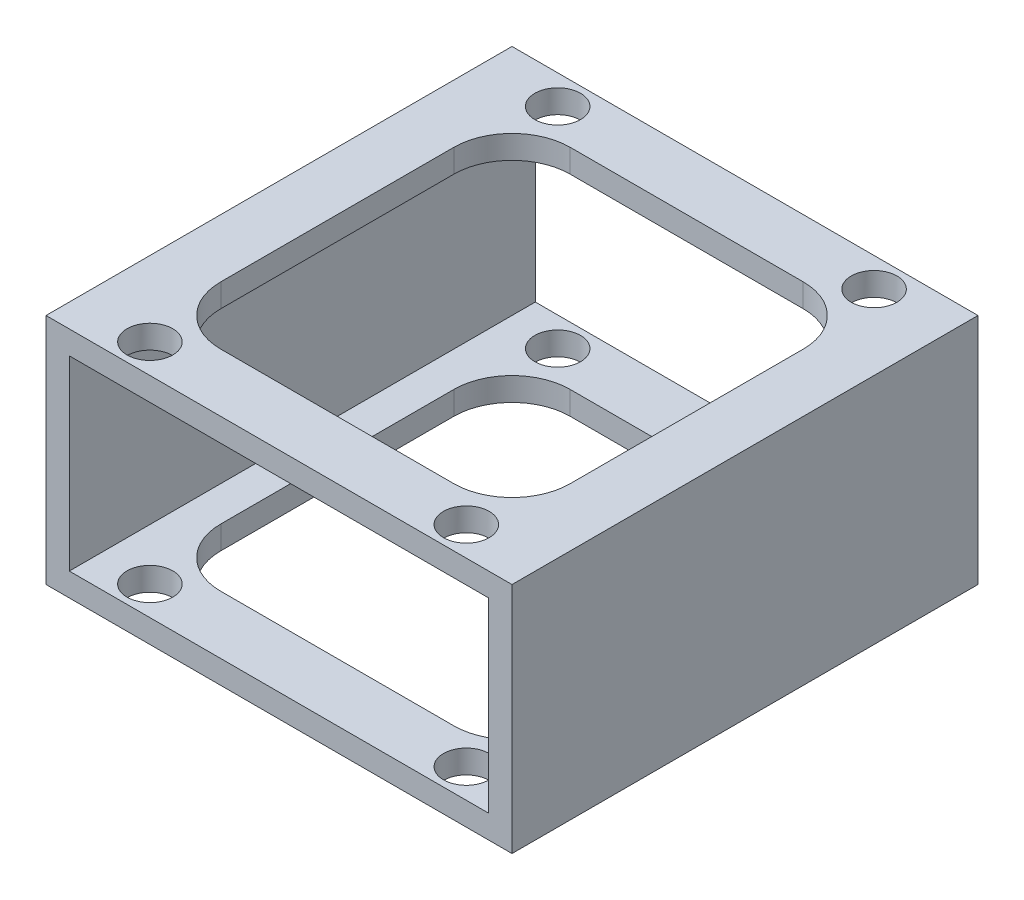
ISO-10303-21;
HEADER;
FILE_DESCRIPTION(('STEP AP214'),'2;1');
FILE_NAME('part.step','',(''),(''),'','','');
FILE_SCHEMA(('AUTOMOTIVE_DESIGN { 1 0 10303 214 1 1 1 1 }'));
ENDSEC;
DATA;
#1=APPLICATION_CONTEXT('core data for automotive mechanical design processes');
#2=APPLICATION_PROTOCOL_DEFINITION('international standard','automotive_design',2000,#1);
#3=PRODUCT_CONTEXT('',#1,'mechanical');
#4=PRODUCT('Part','Part','',(#3));
#5=PRODUCT_RELATED_PRODUCT_CATEGORY('part','',(#4));
#6=PRODUCT_DEFINITION_FORMATION('','',#4);
#7=PRODUCT_DEFINITION_CONTEXT('part definition',#1,'design');
#8=PRODUCT_DEFINITION('design','',#6,#7);
#9=PRODUCT_DEFINITION_SHAPE('','',#8);
#10=(LENGTH_UNIT() NAMED_UNIT(*) SI_UNIT(.MILLI.,.METRE.));
#11=(NAMED_UNIT(*) PLANE_ANGLE_UNIT() SI_UNIT($,.RADIAN.));
#12=(NAMED_UNIT(*) SI_UNIT($,.STERADIAN.) SOLID_ANGLE_UNIT());
#13=UNCERTAINTY_MEASURE_WITH_UNIT(LENGTH_MEASURE(1.E-05),#10,'distance_accuracy_value','');
#14=(GEOMETRIC_REPRESENTATION_CONTEXT(3) GLOBAL_UNCERTAINTY_ASSIGNED_CONTEXT((#13)) GLOBAL_UNIT_ASSIGNED_CONTEXT((#10,
#11,#12)) REPRESENTATION_CONTEXT('',''));
#15=CARTESIAN_POINT('',(0.,0.,0.));
#16=DIRECTION('',(0.,0.,1.));
#17=DIRECTION('',(1.,0.,0.));
#18=AXIS2_PLACEMENT_3D('',#15,#16,#17);
#19=CARTESIAN_POINT('',(-25.4,12.7,50.8));
#20=DIRECTION('',(0.,-1.,0.));
#21=DIRECTION('',(0.,0.,-1.));
#22=AXIS2_PLACEMENT_3D('',#19,#20,#21);
#23=PLANE('',#22);
#24=CARTESIAN_POINT('',(-17.2466,12.7,3.17499999999998));
#25=DIRECTION('',(0.,1.,0.));
#26=DIRECTION('',(0.,0.,1.));
#27=AXIS2_PLACEMENT_3D('',#24,#25,#26);
#28=CIRCLE('',#27,2.4892);
#29=CARTESIAN_POINT('',(-17.2466,12.7,5.66419999999998));
#30=VERTEX_POINT('',#29);
#31=EDGE_CURVE('E438',#30,#30,#28,.T.);
#32=ORIENTED_EDGE('',*,*,#31,.F.);
#33=EDGE_LOOP('',(#32));
#34=FACE_BOUND('',#33,.T.);
#35=CARTESIAN_POINT('',(17.2466,12.7,3.17499999999999));
#36=DIRECTION('',(0.,1.,0.));
#37=DIRECTION('',(0.,0.,1.));
#38=AXIS2_PLACEMENT_3D('',#35,#36,#37);
#39=CIRCLE('',#38,2.4892);
#40=CARTESIAN_POINT('',(17.2466,12.7,5.66419999999999));
#41=VERTEX_POINT('',#40);
#42=EDGE_CURVE('E444',#41,#41,#39,.T.);
#43=ORIENTED_EDGE('',*,*,#42,.F.);
#44=EDGE_LOOP('',(#43));
#45=FACE_BOUND('',#44,.T.);
#46=CARTESIAN_POINT('',(17.2466,12.7,47.625));
#47=DIRECTION('',(0.,1.,0.));
#48=DIRECTION('',(0.,0.,1.));
#49=AXIS2_PLACEMENT_3D('',#46,#47,#48);
#50=CIRCLE('',#49,2.4892);
#51=CARTESIAN_POINT('',(17.2466,12.7,50.1142));
#52=VERTEX_POINT('',#51);
#53=EDGE_CURVE('E450',#52,#52,#50,.T.);
#54=ORIENTED_EDGE('',*,*,#53,.F.);
#55=EDGE_LOOP('',(#54));
#56=FACE_BOUND('',#55,.T.);
#57=CARTESIAN_POINT('',(-17.2466,12.7,47.625));
#58=DIRECTION('',(0.,1.,0.));
#59=DIRECTION('',(0.,0.,1.));
#60=AXIS2_PLACEMENT_3D('',#57,#58,#59);
#61=CIRCLE('',#60,2.4892);
#62=CARTESIAN_POINT('',(-17.2466,12.7,50.1142));
#63=VERTEX_POINT('',#62);
#64=EDGE_CURVE('E432',#63,#63,#61,.T.);
#65=ORIENTED_EDGE('',*,*,#64,.F.);
#66=EDGE_LOOP('',(#65));
#67=FACE_BOUND('',#66,.T.);
#68=DIRECTION('',(-1.,0.,0.));
#69=VECTOR('',#68,1.);
#70=CARTESIAN_POINT('',(-25.4,12.7,0.));
#71=LINE('',#70,#69);
#72=CARTESIAN_POINT('',(25.4,12.7,0.));
#73=VERTEX_POINT('',#72);
#74=CARTESIAN_POINT('',(-25.4,12.7,0.));
#75=VERTEX_POINT('',#74);
#76=EDGE_CURVE('E377',#73,#75,#71,.T.);
#77=ORIENTED_EDGE('',*,*,#76,.T.);
#78=DIRECTION('',(0.,0.,-1.));
#79=VECTOR('',#78,1.);
#80=CARTESIAN_POINT('',(-25.4,12.7,50.8));
#81=LINE('',#80,#79);
#82=CARTESIAN_POINT('',(-25.4,12.7,50.8));
#83=VERTEX_POINT('',#82);
#84=EDGE_CURVE('E387',#83,#75,#81,.T.);
#85=ORIENTED_EDGE('',*,*,#84,.F.);
#86=DIRECTION('',(-1.,0.,0.));
#87=VECTOR('',#86,1.);
#88=CARTESIAN_POINT('',(-25.4,12.7,50.8));
#89=LINE('',#88,#87);
#90=CARTESIAN_POINT('',(25.4,12.7,50.8));
#91=VERTEX_POINT('',#90);
#92=EDGE_CURVE('E367',#91,#83,#89,.T.);
#93=ORIENTED_EDGE('',*,*,#92,.F.);
#94=DIRECTION('',(0.,0.,-1.));
#95=VECTOR('',#94,1.);
#96=CARTESIAN_POINT('',(25.4,12.7,50.8));
#97=LINE('',#96,#95);
#98=EDGE_CURVE('E390',#91,#73,#97,.T.);
#99=ORIENTED_EDGE('',*,*,#98,.T.);
#100=EDGE_LOOP('',(#77,#85,#93,#99));
#101=FACE_BOUND('',#100,.T.);
#102=CARTESIAN_POINT('',(-12.6999999999998,12.7,38.0999999999999));
#103=DIRECTION('',(0.,1.,0.));
#104=DIRECTION('',(0.,0.,1.));
#105=AXIS2_PLACEMENT_3D('',#102,#103,#104);
#106=CIRCLE('',#105,6.35);
#107=CARTESIAN_POINT('',(-12.6999999999998,12.7,44.45));
#108=VERTEX_POINT('',#107);
#109=CARTESIAN_POINT('',(-19.05,12.7,38.0999999999999));
#110=VERTEX_POINT('',#109);
#111=EDGE_CURVE('E80',#108,#110,#106,.F.);
#112=ORIENTED_EDGE('',*,*,#111,.T.);
#113=DIRECTION('',(0.,0.,-1.));
#114=VECTOR('',#113,1.);
#115=CARTESIAN_POINT('',(-19.05,12.7,0.));
#116=LINE('',#115,#114);
#117=CARTESIAN_POINT('',(-19.05,12.7,12.7));
#118=VERTEX_POINT('',#117);
#119=EDGE_CURVE('E248',#110,#118,#116,.T.);
#120=ORIENTED_EDGE('',*,*,#119,.T.);
#121=CARTESIAN_POINT('',(-12.7,12.7,12.7));
#122=DIRECTION('',(0.,1.,0.));
#123=DIRECTION('',(0.,0.,1.));
#124=AXIS2_PLACEMENT_3D('',#121,#122,#123);
#125=CIRCLE('',#124,6.35);
#126=CARTESIAN_POINT('',(-12.7,12.7,6.35));
#127=VERTEX_POINT('',#126);
#128=EDGE_CURVE('E251',#118,#127,#125,.F.);
#129=ORIENTED_EDGE('',*,*,#128,.T.);
#130=DIRECTION('',(1.,0.,0.));
#131=VECTOR('',#130,1.);
#132=CARTESIAN_POINT('',(0.,12.7,6.35));
#133=LINE('',#132,#131);
#134=CARTESIAN_POINT('',(12.7,12.7,6.35));
#135=VERTEX_POINT('',#134);
#136=EDGE_CURVE('E281',#127,#135,#133,.T.);
#137=ORIENTED_EDGE('',*,*,#136,.T.);
#138=CARTESIAN_POINT('',(12.7,12.7,12.6999999999997));
#139=DIRECTION('',(0.,1.,0.));
#140=DIRECTION('',(0.,0.,1.));
#141=AXIS2_PLACEMENT_3D('',#138,#139,#140);
#142=CIRCLE('',#141,6.35);
#143=CARTESIAN_POINT('',(19.05,12.7,12.6999999999997));
#144=VERTEX_POINT('',#143);
#145=EDGE_CURVE('E278',#135,#144,#142,.F.);
#146=ORIENTED_EDGE('',*,*,#145,.T.);
#147=DIRECTION('',(0.,0.,-1.));
#148=VECTOR('',#147,1.);
#149=CARTESIAN_POINT('',(19.05,12.7,0.));
#150=LINE('',#149,#148);
#151=CARTESIAN_POINT('',(19.05,12.7,38.0999999999997));
#152=VERTEX_POINT('',#151);
#153=EDGE_CURVE('E275',#152,#144,#150,.T.);
#154=ORIENTED_EDGE('',*,*,#153,.F.);
#155=CARTESIAN_POINT('',(12.7000000000003,12.7,38.0999999999997));
#156=DIRECTION('',(0.,1.,0.));
#157=DIRECTION('',(0.,0.,1.));
#158=AXIS2_PLACEMENT_3D('',#155,#156,#157);
#159=CIRCLE('',#158,6.35);
#160=CARTESIAN_POINT('',(12.7000000000003,12.7,44.45));
#161=VERTEX_POINT('',#160);
#162=EDGE_CURVE('E272',#152,#161,#159,.F.);
#163=ORIENTED_EDGE('',*,*,#162,.T.);
#164=DIRECTION('',(1.,0.,0.));
#165=VECTOR('',#164,1.);
#166=CARTESIAN_POINT('',(0.,12.7,44.45));
#167=LINE('',#166,#165);
#168=EDGE_CURVE('E269',#108,#161,#167,.T.);
#169=ORIENTED_EDGE('',*,*,#168,.F.);
#170=EDGE_LOOP('',(#112,#120,#129,#137,#146,#154,#163,#169));
#171=FACE_BOUND('',#170,.T.);
#172=ADVANCED_FACE('F63',(#34,#45,#56,#67,#101,#171),#23,.F.);
#173=CARTESIAN_POINT('',(-25.4,-12.7,50.8));
#174=DIRECTION('',(0.,1.,0.));
#175=DIRECTION('',(0.,0.,1.));
#176=AXIS2_PLACEMENT_3D('',#173,#174,#175);
#177=PLANE('',#176);
#178=CARTESIAN_POINT('',(-17.2466,-12.7,3.17499999999998));
#179=DIRECTION('',(0.,1.,0.));
#180=DIRECTION('',(0.,0.,1.));
#181=AXIS2_PLACEMENT_3D('',#178,#179,#180);
#182=CIRCLE('',#181,2.4892);
#183=CARTESIAN_POINT('',(-17.2466,-12.7,5.66419999999998));
#184=VERTEX_POINT('',#183);
#185=EDGE_CURVE('E441',#184,#184,#182,.T.);
#186=ORIENTED_EDGE('',*,*,#185,.T.);
#187=EDGE_LOOP('',(#186));
#188=FACE_BOUND('',#187,.T.);
#189=CARTESIAN_POINT('',(17.2466,-12.7,3.17499999999999));
#190=DIRECTION('',(0.,1.,0.));
#191=DIRECTION('',(0.,0.,1.));
#192=AXIS2_PLACEMENT_3D('',#189,#190,#191);
#193=CIRCLE('',#192,2.4892);
#194=CARTESIAN_POINT('',(17.2466,-12.7,5.66419999999999));
#195=VERTEX_POINT('',#194);
#196=EDGE_CURVE('E447',#195,#195,#193,.T.);
#197=ORIENTED_EDGE('',*,*,#196,.T.);
#198=EDGE_LOOP('',(#197));
#199=FACE_BOUND('',#198,.T.);
#200=CARTESIAN_POINT('',(17.2466,-12.7,47.625));
#201=DIRECTION('',(0.,1.,0.));
#202=DIRECTION('',(0.,0.,1.));
#203=AXIS2_PLACEMENT_3D('',#200,#201,#202);
#204=CIRCLE('',#203,2.4892);
#205=CARTESIAN_POINT('',(17.2466,-12.7,50.1142));
#206=VERTEX_POINT('',#205);
#207=EDGE_CURVE('E435',#206,#206,#204,.T.);
#208=ORIENTED_EDGE('',*,*,#207,.T.);
#209=EDGE_LOOP('',(#208));
#210=FACE_BOUND('',#209,.T.);
#211=CARTESIAN_POINT('',(-17.2466,-12.7,47.625));
#212=DIRECTION('',(0.,1.,0.));
#213=DIRECTION('',(0.,0.,1.));
#214=AXIS2_PLACEMENT_3D('',#211,#212,#213);
#215=CIRCLE('',#214,2.4892);
#216=CARTESIAN_POINT('',(-17.2466,-12.7,50.1142));
#217=VERTEX_POINT('',#216);
#218=EDGE_CURVE('E415',#217,#217,#215,.T.);
#219=ORIENTED_EDGE('',*,*,#218,.T.);
#220=EDGE_LOOP('',(#219));
#221=FACE_BOUND('',#220,.T.);
#222=DIRECTION('',(1.,0.,0.));
#223=VECTOR('',#222,1.);
#224=CARTESIAN_POINT('',(-25.4,-12.7,0.));
#225=LINE('',#224,#223);
#226=CARTESIAN_POINT('',(-25.4,-12.7,0.));
#227=VERTEX_POINT('',#226);
#228=CARTESIAN_POINT('',(25.4,-12.7,0.));
#229=VERTEX_POINT('',#228);
#230=EDGE_CURVE('E368',#227,#229,#225,.T.);
#231=ORIENTED_EDGE('',*,*,#230,.T.);
#232=DIRECTION('',(0.,0.,-1.));
#233=VECTOR('',#232,1.);
#234=CARTESIAN_POINT('',(25.4,-12.7,50.8));
#235=LINE('',#234,#233);
#236=CARTESIAN_POINT('',(25.4,-12.7,50.8));
#237=VERTEX_POINT('',#236);
#238=EDGE_CURVE('E374',#237,#229,#235,.T.);
#239=ORIENTED_EDGE('',*,*,#238,.F.);
#240=DIRECTION('',(1.,0.,0.));
#241=VECTOR('',#240,1.);
#242=CARTESIAN_POINT('',(-25.4,-12.7,50.8));
#243=LINE('',#242,#241);
#244=CARTESIAN_POINT('',(-25.4,-12.7,50.8));
#245=VERTEX_POINT('',#244);
#246=EDGE_CURVE('E372',#245,#237,#243,.T.);
#247=ORIENTED_EDGE('',*,*,#246,.F.);
#248=DIRECTION('',(0.,0.,-1.));
#249=VECTOR('',#248,1.);
#250=CARTESIAN_POINT('',(-25.4,-12.7,50.8));
#251=LINE('',#250,#249);
#252=EDGE_CURVE('E384',#245,#227,#251,.T.);
#253=ORIENTED_EDGE('',*,*,#252,.T.);
#254=EDGE_LOOP('',(#231,#239,#247,#253));
#255=FACE_BOUND('',#254,.T.);
#256=CARTESIAN_POINT('',(-12.6999999999998,-12.7,38.0999999999999));
#257=DIRECTION('',(0.,1.,0.));
#258=DIRECTION('',(0.,0.,1.));
#259=AXIS2_PLACEMENT_3D('',#256,#257,#258);
#260=CIRCLE('',#259,6.35);
#261=CARTESIAN_POINT('',(-12.6999999999998,-12.7,44.45));
#262=VERTEX_POINT('',#261);
#263=CARTESIAN_POINT('',(-19.05,-12.7,38.0999999999999));
#264=VERTEX_POINT('',#263);
#265=EDGE_CURVE('E231',#262,#264,#260,.F.);
#266=ORIENTED_EDGE('',*,*,#265,.F.);
#267=DIRECTION('',(1.,0.,0.));
#268=VECTOR('',#267,1.);
#269=CARTESIAN_POINT('',(0.,-12.7,44.45));
#270=LINE('',#269,#268);
#271=CARTESIAN_POINT('',(12.7000000000003,-12.7,44.45));
#272=VERTEX_POINT('',#271);
#273=EDGE_CURVE('E238',#262,#272,#270,.T.);
#274=ORIENTED_EDGE('',*,*,#273,.T.);
#275=CARTESIAN_POINT('',(12.7000000000003,-12.7,38.0999999999997));
#276=DIRECTION('',(0.,1.,0.));
#277=DIRECTION('',(0.,0.,1.));
#278=AXIS2_PLACEMENT_3D('',#275,#276,#277);
#279=CIRCLE('',#278,6.35);
#280=CARTESIAN_POINT('',(19.05,-12.7,38.0999999999997));
#281=VERTEX_POINT('',#280);
#282=EDGE_CURVE('E242',#281,#272,#279,.F.);
#283=ORIENTED_EDGE('',*,*,#282,.F.);
#284=DIRECTION('',(0.,0.,-1.));
#285=VECTOR('',#284,1.);
#286=CARTESIAN_POINT('',(19.05,-12.7,0.));
#287=LINE('',#286,#285);
#288=CARTESIAN_POINT('',(19.05,-12.7,12.6999999999997));
#289=VERTEX_POINT('',#288);
#290=EDGE_CURVE('E258',#281,#289,#287,.T.);
#291=ORIENTED_EDGE('',*,*,#290,.T.);
#292=CARTESIAN_POINT('',(12.7,-12.7,12.6999999999997));
#293=DIRECTION('',(0.,1.,0.));
#294=DIRECTION('',(0.,0.,1.));
#295=AXIS2_PLACEMENT_3D('',#292,#293,#294);
#296=CIRCLE('',#295,6.35);
#297=CARTESIAN_POINT('',(12.7,-12.7,6.35));
#298=VERTEX_POINT('',#297);
#299=EDGE_CURVE('E261',#298,#289,#296,.F.);
#300=ORIENTED_EDGE('',*,*,#299,.F.);
#301=DIRECTION('',(1.,0.,0.));
#302=VECTOR('',#301,1.);
#303=CARTESIAN_POINT('',(0.,-12.7,6.35));
#304=LINE('',#303,#302);
#305=CARTESIAN_POINT('',(-12.7,-12.7,6.35));
#306=VERTEX_POINT('',#305);
#307=EDGE_CURVE('E263',#306,#298,#304,.T.);
#308=ORIENTED_EDGE('',*,*,#307,.F.);
#309=CARTESIAN_POINT('',(-12.7,-12.7,12.7));
#310=DIRECTION('',(0.,1.,0.));
#311=DIRECTION('',(0.,0.,1.));
#312=AXIS2_PLACEMENT_3D('',#309,#310,#311);
#313=CIRCLE('',#312,6.35);
#314=CARTESIAN_POINT('',(-19.05,-12.7,12.7));
#315=VERTEX_POINT('',#314);
#316=EDGE_CURVE('E265',#315,#306,#313,.F.);
#317=ORIENTED_EDGE('',*,*,#316,.F.);
#318=DIRECTION('',(0.,0.,-1.));
#319=VECTOR('',#318,1.);
#320=CARTESIAN_POINT('',(-19.05,-12.7,0.));
#321=LINE('',#320,#319);
#322=EDGE_CURVE('E247',#264,#315,#321,.T.);
#323=ORIENTED_EDGE('',*,*,#322,.F.);
#324=EDGE_LOOP('',(#266,#274,#283,#291,#300,#308,#317,#323));
#325=FACE_BOUND('',#324,.T.);
#326=ADVANCED_FACE('F245',(#188,#199,#210,#221,#255,#325),#177,.F.);
#327=CARTESIAN_POINT('',(0.,10.16,50.8));
#328=DIRECTION('',(0.,-1.,0.));
#329=DIRECTION('',(0.,0.,-1.));
#330=AXIS2_PLACEMENT_3D('',#327,#328,#329);
#331=PLANE('',#330);
#332=CARTESIAN_POINT('',(-17.2466,10.16,3.17499999999998));
#333=DIRECTION('',(0.,-1.,0.));
#334=DIRECTION('',(0.,0.,-1.));
#335=AXIS2_PLACEMENT_3D('',#332,#333,#334);
#336=CIRCLE('',#335,2.4892);
#337=CARTESIAN_POINT('',(-17.2466,10.16,0.685799999999983));
#338=VERTEX_POINT('',#337);
#339=EDGE_CURVE('E254',#338,#338,#336,.T.);
#340=ORIENTED_EDGE('',*,*,#339,.F.);
#341=EDGE_LOOP('',(#340));
#342=FACE_BOUND('',#341,.T.);
#343=CARTESIAN_POINT('',(17.2466,10.16,3.17499999999999));
#344=DIRECTION('',(0.,-1.,0.));
#345=DIRECTION('',(0.,0.,-1.));
#346=AXIS2_PLACEMENT_3D('',#343,#344,#345);
#347=CIRCLE('',#346,2.4892);
#348=CARTESIAN_POINT('',(17.2466,10.16,0.68579999999999));
#349=VERTEX_POINT('',#348);
#350=EDGE_CURVE('E421',#349,#349,#347,.T.);
#351=ORIENTED_EDGE('',*,*,#350,.F.);
#352=EDGE_LOOP('',(#351));
#353=FACE_BOUND('',#352,.T.);
#354=CARTESIAN_POINT('',(17.2466,10.16,47.625));
#355=DIRECTION('',(0.,-1.,0.));
#356=DIRECTION('',(0.,0.,-1.));
#357=AXIS2_PLACEMENT_3D('',#354,#355,#356);
#358=CIRCLE('',#357,2.4892);
#359=CARTESIAN_POINT('',(17.2466,10.16,45.1358));
#360=VERTEX_POINT('',#359);
#361=EDGE_CURVE('E418',#360,#360,#358,.T.);
#362=ORIENTED_EDGE('',*,*,#361,.F.);
#363=EDGE_LOOP('',(#362));
#364=FACE_BOUND('',#363,.T.);
#365=CARTESIAN_POINT('',(-17.2466,10.16,47.625));
#366=DIRECTION('',(0.,-1.,0.));
#367=DIRECTION('',(0.,0.,-1.));
#368=AXIS2_PLACEMENT_3D('',#365,#366,#367);
#369=CIRCLE('',#368,2.4892);
#370=CARTESIAN_POINT('',(-17.2466,10.16,45.1358));
#371=VERTEX_POINT('',#370);
#372=EDGE_CURVE('E414',#371,#371,#369,.T.);
#373=ORIENTED_EDGE('',*,*,#372,.F.);
#374=EDGE_LOOP('',(#373));
#375=FACE_BOUND('',#374,.T.);
#376=DIRECTION('',(-1.,0.,0.));
#377=VECTOR('',#376,1.);
#378=CARTESIAN_POINT('',(0.,10.16,0.));
#379=LINE('',#378,#377);
#380=CARTESIAN_POINT('',(22.86,10.16,0.));
#381=VERTEX_POINT('',#380);
#382=CARTESIAN_POINT('',(-22.86,10.16,0.));
#383=VERTEX_POINT('',#382);
#384=EDGE_CURVE('E346',#381,#383,#379,.T.);
#385=ORIENTED_EDGE('',*,*,#384,.F.);
#386=DIRECTION('',(0.,0.,-1.));
#387=VECTOR('',#386,1.);
#388=CARTESIAN_POINT('',(22.86,10.16,50.8));
#389=LINE('',#388,#387);
#390=CARTESIAN_POINT('',(22.86,10.16,50.8));
#391=VERTEX_POINT('',#390);
#392=EDGE_CURVE('E360',#391,#381,#389,.T.);
#393=ORIENTED_EDGE('',*,*,#392,.F.);
#394=DIRECTION('',(-1.,0.,0.));
#395=VECTOR('',#394,1.);
#396=CARTESIAN_POINT('',(0.,10.16,50.8));
#397=LINE('',#396,#395);
#398=CARTESIAN_POINT('',(-22.86,10.16,50.8));
#399=VERTEX_POINT('',#398);
#400=EDGE_CURVE('E335',#391,#399,#397,.T.);
#401=ORIENTED_EDGE('',*,*,#400,.T.);
#402=DIRECTION('',(0.,0.,-1.));
#403=VECTOR('',#402,1.);
#404=CARTESIAN_POINT('',(-22.86,10.16,50.8));
#405=LINE('',#404,#403);
#406=EDGE_CURVE('E358',#399,#383,#405,.T.);
#407=ORIENTED_EDGE('',*,*,#406,.T.);
#408=EDGE_LOOP('',(#385,#393,#401,#407));
#409=FACE_BOUND('',#408,.T.);
#410=DIRECTION('',(0.,0.,1.));
#411=VECTOR('',#410,1.);
#412=CARTESIAN_POINT('',(-19.05,10.16,50.8));
#413=LINE('',#412,#411);
#414=CARTESIAN_POINT('',(-19.05,10.16,12.7));
#415=VERTEX_POINT('',#414);
#416=CARTESIAN_POINT('',(-19.05,10.16,38.0999999999999));
#417=VERTEX_POINT('',#416);
#418=EDGE_CURVE('E326',#415,#417,#413,.T.);
#419=ORIENTED_EDGE('',*,*,#418,.T.);
#420=CARTESIAN_POINT('',(-12.6999999999998,10.16,38.0999999999999));
#421=DIRECTION('',(0.,-1.,0.));
#422=DIRECTION('',(0.,0.,-1.));
#423=AXIS2_PLACEMENT_3D('',#420,#421,#422);
#424=CIRCLE('',#423,6.35);
#425=CARTESIAN_POINT('',(-12.6999999999998,10.16,44.45));
#426=VERTEX_POINT('',#425);
#427=EDGE_CURVE('E329',#417,#426,#424,.F.);
#428=ORIENTED_EDGE('',*,*,#427,.T.);
#429=DIRECTION('',(-1.,0.,0.));
#430=VECTOR('',#429,1.);
#431=CARTESIAN_POINT('',(0.,10.16,44.45));
#432=LINE('',#431,#430);
#433=CARTESIAN_POINT('',(12.7000000000003,10.16,44.45));
#434=VERTEX_POINT('',#433);
#435=EDGE_CURVE('E288',#434,#426,#432,.T.);
#436=ORIENTED_EDGE('',*,*,#435,.F.);
#437=CARTESIAN_POINT('',(12.7000000000003,10.16,38.0999999999997));
#438=DIRECTION('',(0.,-1.,0.));
#439=DIRECTION('',(0.,0.,-1.));
#440=AXIS2_PLACEMENT_3D('',#437,#438,#439);
#441=CIRCLE('',#440,6.35);
#442=CARTESIAN_POINT('',(19.05,10.16,38.0999999999997));
#443=VERTEX_POINT('',#442);
#444=EDGE_CURVE('E312',#434,#443,#441,.F.);
#445=ORIENTED_EDGE('',*,*,#444,.T.);
#446=DIRECTION('',(0.,0.,1.));
#447=VECTOR('',#446,1.);
#448=CARTESIAN_POINT('',(19.05,10.16,50.8));
#449=LINE('',#448,#447);
#450=CARTESIAN_POINT('',(19.05,10.16,12.6999999999997));
#451=VERTEX_POINT('',#450);
#452=EDGE_CURVE('E315',#451,#443,#449,.T.);
#453=ORIENTED_EDGE('',*,*,#452,.F.);
#454=CARTESIAN_POINT('',(12.7,10.16,12.6999999999997));
#455=DIRECTION('',(0.,-1.,0.));
#456=DIRECTION('',(0.,0.,-1.));
#457=AXIS2_PLACEMENT_3D('',#454,#455,#456);
#458=CIRCLE('',#457,6.35);
#459=CARTESIAN_POINT('',(12.7,10.16,6.35));
#460=VERTEX_POINT('',#459);
#461=EDGE_CURVE('E317',#451,#460,#458,.F.);
#462=ORIENTED_EDGE('',*,*,#461,.T.);
#463=DIRECTION('',(-1.,0.,0.));
#464=VECTOR('',#463,1.);
#465=CARTESIAN_POINT('',(0.,10.16,6.35));
#466=LINE('',#465,#464);
#467=CARTESIAN_POINT('',(-12.7,10.16,6.35));
#468=VERTEX_POINT('',#467);
#469=EDGE_CURVE('E320',#460,#468,#466,.T.);
#470=ORIENTED_EDGE('',*,*,#469,.T.);
#471=CARTESIAN_POINT('',(-12.7,10.16,12.7));
#472=DIRECTION('',(0.,-1.,0.));
#473=DIRECTION('',(0.,0.,-1.));
#474=AXIS2_PLACEMENT_3D('',#471,#472,#473);
#475=CIRCLE('',#474,6.35);
#476=EDGE_CURVE('E323',#468,#415,#475,.F.);
#477=ORIENTED_EDGE('',*,*,#476,.T.);
#478=EDGE_LOOP('',(#419,#428,#436,#445,#453,#462,#470,#477));
#479=FACE_BOUND('',#478,.T.);
#480=ADVANCED_FACE('F483',(#342,#353,#364,#375,#409,#479),#331,.T.);
#481=CARTESIAN_POINT('',(0.,-10.16,50.8));
#482=DIRECTION('',(0.,1.,0.));
#483=DIRECTION('',(0.,0.,1.));
#484=AXIS2_PLACEMENT_3D('',#481,#482,#483);
#485=PLANE('',#484);
#486=CARTESIAN_POINT('',(-17.2466,-10.16,3.17499999999998));
#487=DIRECTION('',(0.,1.,0.));
#488=DIRECTION('',(0.,0.,1.));
#489=AXIS2_PLACEMENT_3D('',#486,#487,#488);
#490=CIRCLE('',#489,2.4892);
#491=CARTESIAN_POINT('',(-17.2466,-10.16,5.66419999999998));
#492=VERTEX_POINT('',#491);
#493=EDGE_CURVE('E67',#492,#492,#490,.T.);
#494=ORIENTED_EDGE('',*,*,#493,.F.);
#495=EDGE_LOOP('',(#494));
#496=FACE_BOUND('',#495,.T.);
#497=CARTESIAN_POINT('',(17.2466,-10.16,3.17499999999999));
#498=DIRECTION('',(0.,1.,0.));
#499=DIRECTION('',(0.,0.,1.));
#500=AXIS2_PLACEMENT_3D('',#497,#498,#499);
#501=CIRCLE('',#500,2.4892);
#502=CARTESIAN_POINT('',(17.2466,-10.16,5.66419999999999));
#503=VERTEX_POINT('',#502);
#504=EDGE_CURVE('E419',#503,#503,#501,.T.);
#505=ORIENTED_EDGE('',*,*,#504,.F.);
#506=EDGE_LOOP('',(#505));
#507=FACE_BOUND('',#506,.T.);
#508=CARTESIAN_POINT('',(17.2466,-10.16,47.625));
#509=DIRECTION('',(0.,1.,0.));
#510=DIRECTION('',(0.,0.,1.));
#511=AXIS2_PLACEMENT_3D('',#508,#509,#510);
#512=CIRCLE('',#511,2.4892);
#513=CARTESIAN_POINT('',(17.2466,-10.16,50.1142));
#514=VERTEX_POINT('',#513);
#515=EDGE_CURVE('E416',#514,#514,#512,.T.);
#516=ORIENTED_EDGE('',*,*,#515,.F.);
#517=EDGE_LOOP('',(#516));
#518=FACE_BOUND('',#517,.T.);
#519=CARTESIAN_POINT('',(-17.2466,-10.16,47.625));
#520=DIRECTION('',(0.,1.,0.));
#521=DIRECTION('',(0.,0.,1.));
#522=AXIS2_PLACEMENT_3D('',#519,#520,#521);
#523=CIRCLE('',#522,2.4892);
#524=CARTESIAN_POINT('',(-17.2466,-10.16,50.1142));
#525=VERTEX_POINT('',#524);
#526=EDGE_CURVE('E411',#525,#525,#523,.T.);
#527=ORIENTED_EDGE('',*,*,#526,.F.);
#528=EDGE_LOOP('',(#527));
#529=FACE_BOUND('',#528,.T.);
#530=DIRECTION('',(1.,0.,0.));
#531=VECTOR('',#530,1.);
#532=CARTESIAN_POINT('',(0.,-10.16,0.));
#533=LINE('',#532,#531);
#534=CARTESIAN_POINT('',(-22.86,-10.16,0.));
#535=VERTEX_POINT('',#534);
#536=CARTESIAN_POINT('',(22.86,-10.16,0.));
#537=VERTEX_POINT('',#536);
#538=EDGE_CURVE('E336',#535,#537,#533,.T.);
#539=ORIENTED_EDGE('',*,*,#538,.F.);
#540=DIRECTION('',(0.,0.,-1.));
#541=VECTOR('',#540,1.);
#542=CARTESIAN_POINT('',(-22.86,-10.16,50.8));
#543=LINE('',#542,#541);
#544=CARTESIAN_POINT('',(-22.86,-10.16,50.8));
#545=VERTEX_POINT('',#544);
#546=EDGE_CURVE('E356',#545,#535,#543,.T.);
#547=ORIENTED_EDGE('',*,*,#546,.F.);
#548=DIRECTION('',(1.,0.,0.));
#549=VECTOR('',#548,1.);
#550=CARTESIAN_POINT('',(0.,-10.16,50.8));
#551=LINE('',#550,#549);
#552=CARTESIAN_POINT('',(22.86,-10.16,50.8));
#553=VERTEX_POINT('',#552);
#554=EDGE_CURVE('E341',#545,#553,#551,.T.);
#555=ORIENTED_EDGE('',*,*,#554,.T.);
#556=DIRECTION('',(0.,0.,-1.));
#557=VECTOR('',#556,1.);
#558=CARTESIAN_POINT('',(22.86,-10.16,50.8));
#559=LINE('',#558,#557);
#560=EDGE_CURVE('E343',#553,#537,#559,.T.);
#561=ORIENTED_EDGE('',*,*,#560,.T.);
#562=EDGE_LOOP('',(#539,#547,#555,#561));
#563=FACE_BOUND('',#562,.T.);
#564=DIRECTION('',(1.,0.,0.));
#565=VECTOR('',#564,1.);
#566=CARTESIAN_POINT('',(0.,-10.16,44.45));
#567=LINE('',#566,#565);
#568=CARTESIAN_POINT('',(-12.6999999999998,-10.16,44.45));
#569=VERTEX_POINT('',#568);
#570=CARTESIAN_POINT('',(12.7000000000003,-10.16,44.45));
#571=VERTEX_POINT('',#570);
#572=EDGE_CURVE('E393',#569,#571,#567,.T.);
#573=ORIENTED_EDGE('',*,*,#572,.F.);
#574=CARTESIAN_POINT('',(-12.6999999999998,-10.16,38.0999999999999));
#575=DIRECTION('',(0.,1.,0.));
#576=DIRECTION('',(0.,0.,1.));
#577=AXIS2_PLACEMENT_3D('',#574,#575,#576);
#578=CIRCLE('',#577,6.35);
#579=CARTESIAN_POINT('',(-19.05,-10.16,38.0999999999999));
#580=VERTEX_POINT('',#579);
#581=EDGE_CURVE('E12',#569,#580,#578,.F.);
#582=ORIENTED_EDGE('',*,*,#581,.T.);
#583=DIRECTION('',(0.,0.,-1.));
#584=VECTOR('',#583,1.);
#585=CARTESIAN_POINT('',(-19.05,-10.16,50.8));
#586=LINE('',#585,#584);
#587=CARTESIAN_POINT('',(-19.05,-10.16,12.7));
#588=VERTEX_POINT('',#587);
#589=EDGE_CURVE('E72',#580,#588,#586,.T.);
#590=ORIENTED_EDGE('',*,*,#589,.T.);
#591=CARTESIAN_POINT('',(-12.7,-10.16,12.7));
#592=DIRECTION('',(0.,1.,0.));
#593=DIRECTION('',(0.,0.,1.));
#594=AXIS2_PLACEMENT_3D('',#591,#592,#593);
#595=CIRCLE('',#594,6.35);
#596=CARTESIAN_POINT('',(-12.7,-10.16,6.35));
#597=VERTEX_POINT('',#596);
#598=EDGE_CURVE('E406',#588,#597,#595,.F.);
#599=ORIENTED_EDGE('',*,*,#598,.T.);
#600=DIRECTION('',(1.,0.,0.));
#601=VECTOR('',#600,1.);
#602=CARTESIAN_POINT('',(0.,-10.16,6.35));
#603=LINE('',#602,#601);
#604=CARTESIAN_POINT('',(12.7,-10.16,6.35));
#605=VERTEX_POINT('',#604);
#606=EDGE_CURVE('E403',#597,#605,#603,.T.);
#607=ORIENTED_EDGE('',*,*,#606,.T.);
#608=CARTESIAN_POINT('',(12.7,-10.16,12.6999999999997));
#609=DIRECTION('',(0.,1.,0.));
#610=DIRECTION('',(0.,0.,1.));
#611=AXIS2_PLACEMENT_3D('',#608,#609,#610);
#612=CIRCLE('',#611,6.35);
#613=CARTESIAN_POINT('',(19.05,-10.16,12.6999999999997));
#614=VERTEX_POINT('',#613);
#615=EDGE_CURVE('E400',#605,#614,#612,.F.);
#616=ORIENTED_EDGE('',*,*,#615,.T.);
#617=DIRECTION('',(0.,0.,-1.));
#618=VECTOR('',#617,1.);
#619=CARTESIAN_POINT('',(19.05,-10.16,50.8));
#620=LINE('',#619,#618);
#621=CARTESIAN_POINT('',(19.05,-10.16,38.0999999999997));
#622=VERTEX_POINT('',#621);
#623=EDGE_CURVE('E398',#622,#614,#620,.T.);
#624=ORIENTED_EDGE('',*,*,#623,.F.);
#625=CARTESIAN_POINT('',(12.7000000000003,-10.16,38.0999999999997));
#626=DIRECTION('',(0.,1.,0.));
#627=DIRECTION('',(0.,0.,1.));
#628=AXIS2_PLACEMENT_3D('',#625,#626,#627);
#629=CIRCLE('',#628,6.35);
#630=EDGE_CURVE('E395',#622,#571,#629,.F.);
#631=ORIENTED_EDGE('',*,*,#630,.T.);
#632=EDGE_LOOP('',(#573,#582,#590,#599,#607,#616,#624,#631));
#633=FACE_BOUND('',#632,.T.);
#634=ADVANCED_FACE('F501',(#496,#507,#518,#529,#563,#633),#485,.T.);
#635=CARTESIAN_POINT('',(0.,0.,50.8));
#636=DIRECTION('',(0.,0.,1.));
#637=DIRECTION('',(1.,0.,0.));
#638=AXIS2_PLACEMENT_3D('',#635,#636,#637);
#639=PLANE('',#638);
#640=DIRECTION('',(0.,1.,0.));
#641=VECTOR('',#640,1.);
#642=CARTESIAN_POINT('',(25.4,-12.7,50.8));
#643=LINE('',#642,#641);
#644=EDGE_CURVE('E364',#237,#91,#643,.T.);
#645=ORIENTED_EDGE('',*,*,#644,.T.);
#646=ORIENTED_EDGE('',*,*,#92,.T.);
#647=DIRECTION('',(0.,-1.,0.));
#648=VECTOR('',#647,1.);
#649=CARTESIAN_POINT('',(-25.4,-12.7,50.8));
#650=LINE('',#649,#648);
#651=EDGE_CURVE('E370',#83,#245,#650,.T.);
#652=ORIENTED_EDGE('',*,*,#651,.T.);
#653=ORIENTED_EDGE('',*,*,#246,.T.);
#654=EDGE_LOOP('',(#645,#646,#652,#653));
#655=FACE_BOUND('',#654,.T.);
#656=ORIENTED_EDGE('',*,*,#400,.F.);
#657=DIRECTION('',(0.,1.,0.));
#658=VECTOR('',#657,1.);
#659=CARTESIAN_POINT('',(22.86,0.,50.8));
#660=LINE('',#659,#658);
#661=EDGE_CURVE('E333',#553,#391,#660,.T.);
#662=ORIENTED_EDGE('',*,*,#661,.F.);
#663=ORIENTED_EDGE('',*,*,#554,.F.);
#664=DIRECTION('',(0.,-1.,0.));
#665=VECTOR('',#664,1.);
#666=CARTESIAN_POINT('',(-22.86,0.,50.8));
#667=LINE('',#666,#665);
#668=EDGE_CURVE('E338',#399,#545,#667,.T.);
#669=ORIENTED_EDGE('',*,*,#668,.F.);
#670=EDGE_LOOP('',(#656,#662,#663,#669));
#671=FACE_BOUND('',#670,.T.);
#672=ADVANCED_FACE('F497',(#655,#671),#639,.T.);
#673=CARTESIAN_POINT('',(0.,0.,0.));
#674=DIRECTION('',(0.,0.,1.));
#675=DIRECTION('',(1.,0.,0.));
#676=AXIS2_PLACEMENT_3D('',#673,#674,#675);
#677=PLANE('',#676);
#678=DIRECTION('',(0.,1.,0.));
#679=VECTOR('',#678,1.);
#680=CARTESIAN_POINT('',(25.4,-12.7,0.));
#681=LINE('',#680,#679);
#682=EDGE_CURVE('E363',#229,#73,#681,.T.);
#683=ORIENTED_EDGE('',*,*,#682,.F.);
#684=ORIENTED_EDGE('',*,*,#230,.F.);
#685=DIRECTION('',(0.,-1.,0.));
#686=VECTOR('',#685,1.);
#687=CARTESIAN_POINT('',(-25.4,-12.7,0.));
#688=LINE('',#687,#686);
#689=EDGE_CURVE('E379',#75,#227,#688,.T.);
#690=ORIENTED_EDGE('',*,*,#689,.F.);
#691=ORIENTED_EDGE('',*,*,#76,.F.);
#692=EDGE_LOOP('',(#683,#684,#690,#691));
#693=FACE_BOUND('',#692,.T.);
#694=DIRECTION('',(0.,1.,0.));
#695=VECTOR('',#694,1.);
#696=CARTESIAN_POINT('',(22.86,0.,0.));
#697=LINE('',#696,#695);
#698=EDGE_CURVE('E332',#537,#381,#697,.T.);
#699=ORIENTED_EDGE('',*,*,#698,.T.);
#700=ORIENTED_EDGE('',*,*,#384,.T.);
#701=DIRECTION('',(0.,-1.,0.));
#702=VECTOR('',#701,1.);
#703=CARTESIAN_POINT('',(-22.86,0.,0.));
#704=LINE('',#703,#702);
#705=EDGE_CURVE('E349',#383,#535,#704,.T.);
#706=ORIENTED_EDGE('',*,*,#705,.T.);
#707=ORIENTED_EDGE('',*,*,#538,.T.);
#708=EDGE_LOOP('',(#699,#700,#706,#707));
#709=FACE_BOUND('',#708,.T.);
#710=ADVANCED_FACE('F494',(#693,#709),#677,.F.);
#711=CARTESIAN_POINT('',(25.4,-12.7,50.8));
#712=DIRECTION('',(-1.,0.,0.));
#713=DIRECTION('',(0.,0.,1.));
#714=AXIS2_PLACEMENT_3D('',#711,#712,#713);
#715=PLANE('',#714);
#716=ORIENTED_EDGE('',*,*,#682,.T.);
#717=ORIENTED_EDGE('',*,*,#98,.F.);
#718=ORIENTED_EDGE('',*,*,#644,.F.);
#719=ORIENTED_EDGE('',*,*,#238,.T.);
#720=EDGE_LOOP('',(#716,#717,#718,#719));
#721=FACE_BOUND('',#720,.T.);
#722=ADVANCED_FACE('F65',(#721),#715,.F.);
#723=CARTESIAN_POINT('',(-25.4,-12.7,50.8));
#724=DIRECTION('',(1.,0.,0.));
#725=DIRECTION('',(0.,0.,-1.));
#726=AXIS2_PLACEMENT_3D('',#723,#724,#725);
#727=PLANE('',#726);
#728=ORIENTED_EDGE('',*,*,#689,.T.);
#729=ORIENTED_EDGE('',*,*,#252,.F.);
#730=ORIENTED_EDGE('',*,*,#651,.F.);
#731=ORIENTED_EDGE('',*,*,#84,.T.);
#732=EDGE_LOOP('',(#728,#729,#730,#731));
#733=FACE_BOUND('',#732,.T.);
#734=ADVANCED_FACE('F489',(#733),#727,.F.);
#735=CARTESIAN_POINT('',(22.86,0.,50.8));
#736=DIRECTION('',(-1.,0.,0.));
#737=DIRECTION('',(0.,0.,1.));
#738=AXIS2_PLACEMENT_3D('',#735,#736,#737);
#739=PLANE('',#738);
#740=ORIENTED_EDGE('',*,*,#698,.F.);
#741=ORIENTED_EDGE('',*,*,#560,.F.);
#742=ORIENTED_EDGE('',*,*,#661,.T.);
#743=ORIENTED_EDGE('',*,*,#392,.T.);
#744=EDGE_LOOP('',(#740,#741,#742,#743));
#745=FACE_BOUND('',#744,.T.);
#746=ADVANCED_FACE('F491',(#745),#739,.T.);
#747=CARTESIAN_POINT('',(-22.86,0.,50.8));
#748=DIRECTION('',(1.,0.,0.));
#749=DIRECTION('',(0.,0.,-1.));
#750=AXIS2_PLACEMENT_3D('',#747,#748,#749);
#751=PLANE('',#750);
#752=ORIENTED_EDGE('',*,*,#705,.F.);
#753=ORIENTED_EDGE('',*,*,#406,.F.);
#754=ORIENTED_EDGE('',*,*,#668,.T.);
#755=ORIENTED_EDGE('',*,*,#546,.T.);
#756=EDGE_LOOP('',(#752,#753,#754,#755));
#757=FACE_BOUND('',#756,.T.);
#758=ADVANCED_FACE('F505',(#757),#751,.T.);
#759=CARTESIAN_POINT('',(0.,-12.7,44.45));
#760=DIRECTION('',(0.,0.,1.));
#761=DIRECTION('',(1.,0.,0.));
#762=AXIS2_PLACEMENT_3D('',#759,#760,#761);
#763=PLANE('',#762);
#764=ORIENTED_EDGE('',*,*,#572,.T.);
#765=DIRECTION('',(0.,1.,0.));
#766=VECTOR('',#765,1.);
#767=CARTESIAN_POINT('',(12.7000000000003,-12.7,44.45));
#768=LINE('',#767,#766);
#769=EDGE_CURVE('E88',#272,#571,#768,.T.);
#770=ORIENTED_EDGE('',*,*,#769,.F.);
#771=ORIENTED_EDGE('',*,*,#273,.F.);
#772=DIRECTION('',(0.,1.,0.));
#773=VECTOR('',#772,1.);
#774=CARTESIAN_POINT('',(-12.6999999999998,-12.7,44.45));
#775=LINE('',#774,#773);
#776=EDGE_CURVE('E227',#262,#569,#775,.T.);
#777=ORIENTED_EDGE('',*,*,#776,.T.);
#778=EDGE_LOOP('',(#764,#770,#771,#777));
#779=FACE_BOUND('',#778,.T.);
#780=ADVANCED_FACE('F239',(#779),#763,.F.);
#781=CARTESIAN_POINT('',(12.7000000000003,-12.7,38.0999999999997));
#782=DIRECTION('',(0.,1.,0.));
#783=DIRECTION('',(0.,0.,1.));
#784=AXIS2_PLACEMENT_3D('',#781,#782,#783);
#785=CYLINDRICAL_SURFACE('',#784,6.35);
#786=DIRECTION('',(0.,1.,0.));
#787=VECTOR('',#786,1.);
#788=CARTESIAN_POINT('',(19.05,-12.7,38.0999999999997));
#789=LINE('',#788,#787);
#790=EDGE_CURVE('E306',#281,#622,#789,.T.);
#791=ORIENTED_EDGE('',*,*,#790,.F.);
#792=ORIENTED_EDGE('',*,*,#282,.T.);
#793=ORIENTED_EDGE('',*,*,#769,.T.);
#794=ORIENTED_EDGE('',*,*,#630,.F.);
#795=EDGE_LOOP('',(#791,#792,#793,#794));
#796=FACE_BOUND('',#795,.T.);
#797=ADVANCED_FACE('F522',(#796),#785,.F.);
#798=CARTESIAN_POINT('',(19.05,-12.7,0.));
#799=DIRECTION('',(1.,0.,0.));
#800=DIRECTION('',(0.,0.,-1.));
#801=AXIS2_PLACEMENT_3D('',#798,#799,#800);
#802=PLANE('',#801);
#803=ORIENTED_EDGE('',*,*,#623,.T.);
#804=DIRECTION('',(0.,1.,0.));
#805=VECTOR('',#804,1.);
#806=CARTESIAN_POINT('',(19.05,-12.7,12.6999999999997));
#807=LINE('',#806,#805);
#808=EDGE_CURVE('E302',#289,#614,#807,.T.);
#809=ORIENTED_EDGE('',*,*,#808,.F.);
#810=ORIENTED_EDGE('',*,*,#290,.F.);
#811=ORIENTED_EDGE('',*,*,#790,.T.);
#812=EDGE_LOOP('',(#803,#809,#810,#811));
#813=FACE_BOUND('',#812,.T.);
#814=ADVANCED_FACE('F525',(#813),#802,.F.);
#815=CARTESIAN_POINT('',(12.7,-12.7,12.6999999999997));
#816=DIRECTION('',(0.,1.,0.));
#817=DIRECTION('',(0.,0.,1.));
#818=AXIS2_PLACEMENT_3D('',#815,#816,#817);
#819=CYLINDRICAL_SURFACE('',#818,6.35);
#820=DIRECTION('',(0.,1.,0.));
#821=VECTOR('',#820,1.);
#822=CARTESIAN_POINT('',(12.7,-12.7,6.35));
#823=LINE('',#822,#821);
#824=EDGE_CURVE('E298',#298,#605,#823,.T.);
#825=ORIENTED_EDGE('',*,*,#824,.F.);
#826=ORIENTED_EDGE('',*,*,#299,.T.);
#827=ORIENTED_EDGE('',*,*,#808,.T.);
#828=ORIENTED_EDGE('',*,*,#615,.F.);
#829=EDGE_LOOP('',(#825,#826,#827,#828));
#830=FACE_BOUND('',#829,.T.);
#831=ADVANCED_FACE('F530',(#830),#819,.F.);
#832=CARTESIAN_POINT('',(0.,-12.7,6.35));
#833=DIRECTION('',(0.,0.,1.));
#834=DIRECTION('',(1.,0.,0.));
#835=AXIS2_PLACEMENT_3D('',#832,#833,#834);
#836=PLANE('',#835);
#837=DIRECTION('',(0.,1.,0.));
#838=VECTOR('',#837,1.);
#839=CARTESIAN_POINT('',(-12.7,-12.7,6.35));
#840=LINE('',#839,#838);
#841=EDGE_CURVE('E294',#306,#597,#840,.T.);
#842=ORIENTED_EDGE('',*,*,#841,.F.);
#843=ORIENTED_EDGE('',*,*,#307,.T.);
#844=ORIENTED_EDGE('',*,*,#824,.T.);
#845=ORIENTED_EDGE('',*,*,#606,.F.);
#846=EDGE_LOOP('',(#842,#843,#844,#845));
#847=FACE_BOUND('',#846,.T.);
#848=ADVANCED_FACE('F535',(#847),#836,.T.);
#849=CARTESIAN_POINT('',(-12.7,-12.7,12.7));
#850=DIRECTION('',(0.,1.,0.));
#851=DIRECTION('',(0.,0.,1.));
#852=AXIS2_PLACEMENT_3D('',#849,#850,#851);
#853=CYLINDRICAL_SURFACE('',#852,6.35);
#854=DIRECTION('',(0.,1.,0.));
#855=VECTOR('',#854,1.);
#856=CARTESIAN_POINT('',(-19.05,-12.7,12.7));
#857=LINE('',#856,#855);
#858=EDGE_CURVE('E290',#315,#588,#857,.T.);
#859=ORIENTED_EDGE('',*,*,#858,.F.);
#860=ORIENTED_EDGE('',*,*,#316,.T.);
#861=ORIENTED_EDGE('',*,*,#841,.T.);
#862=ORIENTED_EDGE('',*,*,#598,.F.);
#863=EDGE_LOOP('',(#859,#860,#861,#862));
#864=FACE_BOUND('',#863,.T.);
#865=ADVANCED_FACE('F540',(#864),#853,.F.);
#866=CARTESIAN_POINT('',(-19.05,-12.7,0.));
#867=DIRECTION('',(1.,0.,0.));
#868=DIRECTION('',(0.,0.,-1.));
#869=AXIS2_PLACEMENT_3D('',#866,#867,#868);
#870=PLANE('',#869);
#871=DIRECTION('',(0.,1.,0.));
#872=VECTOR('',#871,1.);
#873=CARTESIAN_POINT('',(-19.05,-12.7,38.0999999999999));
#874=LINE('',#873,#872);
#875=EDGE_CURVE('E286',#264,#580,#874,.T.);
#876=ORIENTED_EDGE('',*,*,#875,.F.);
#877=ORIENTED_EDGE('',*,*,#322,.T.);
#878=ORIENTED_EDGE('',*,*,#858,.T.);
#879=ORIENTED_EDGE('',*,*,#589,.F.);
#880=EDGE_LOOP('',(#876,#877,#878,#879));
#881=FACE_BOUND('',#880,.T.);
#882=ADVANCED_FACE('F519',(#881),#870,.T.);
#883=CARTESIAN_POINT('',(-12.6999999999998,-12.7,38.0999999999999));
#884=DIRECTION('',(0.,1.,0.));
#885=DIRECTION('',(0.,0.,1.));
#886=AXIS2_PLACEMENT_3D('',#883,#884,#885);
#887=CYLINDRICAL_SURFACE('',#886,6.35);
#888=ORIENTED_EDGE('',*,*,#776,.F.);
#889=ORIENTED_EDGE('',*,*,#265,.T.);
#890=ORIENTED_EDGE('',*,*,#875,.T.);
#891=ORIENTED_EDGE('',*,*,#581,.F.);
#892=EDGE_LOOP('',(#888,#889,#890,#891));
#893=FACE_BOUND('',#892,.T.);
#894=ADVANCED_FACE('F228',(#893),#887,.F.);
#895=EDGE_CURVE('E289',#417,#110,#874,.T.);
#896=ORIENTED_EDGE('',*,*,#895,.T.);
#897=ORIENTED_EDGE('',*,*,#111,.F.);
#898=EDGE_CURVE('E235',#426,#108,#775,.T.);
#899=ORIENTED_EDGE('',*,*,#898,.F.);
#900=ORIENTED_EDGE('',*,*,#427,.F.);
#901=EDGE_LOOP('',(#896,#897,#899,#900));
#902=FACE_BOUND('',#901,.T.);
#903=ADVANCED_FACE('F518',(#902),#887,.F.);
#904=EDGE_CURVE('E293',#415,#118,#857,.T.);
#905=ORIENTED_EDGE('',*,*,#904,.T.);
#906=ORIENTED_EDGE('',*,*,#119,.F.);
#907=ORIENTED_EDGE('',*,*,#895,.F.);
#908=ORIENTED_EDGE('',*,*,#418,.F.);
#909=EDGE_LOOP('',(#905,#906,#907,#908));
#910=FACE_BOUND('',#909,.T.);
#911=ADVANCED_FACE('F549',(#910),#870,.T.);
#912=EDGE_CURVE('E297',#468,#127,#840,.T.);
#913=ORIENTED_EDGE('',*,*,#912,.T.);
#914=ORIENTED_EDGE('',*,*,#128,.F.);
#915=ORIENTED_EDGE('',*,*,#904,.F.);
#916=ORIENTED_EDGE('',*,*,#476,.F.);
#917=EDGE_LOOP('',(#913,#914,#915,#916));
#918=FACE_BOUND('',#917,.T.);
#919=ADVANCED_FACE('F546',(#918),#853,.F.);
#920=EDGE_CURVE('E301',#460,#135,#823,.T.);
#921=ORIENTED_EDGE('',*,*,#920,.T.);
#922=ORIENTED_EDGE('',*,*,#136,.F.);
#923=ORIENTED_EDGE('',*,*,#912,.F.);
#924=ORIENTED_EDGE('',*,*,#469,.F.);
#925=EDGE_LOOP('',(#921,#922,#923,#924));
#926=FACE_BOUND('',#925,.T.);
#927=ADVANCED_FACE('F542',(#926),#836,.T.);
#928=EDGE_CURVE('E305',#451,#144,#807,.T.);
#929=ORIENTED_EDGE('',*,*,#928,.T.);
#930=ORIENTED_EDGE('',*,*,#145,.F.);
#931=ORIENTED_EDGE('',*,*,#920,.F.);
#932=ORIENTED_EDGE('',*,*,#461,.F.);
#933=EDGE_LOOP('',(#929,#930,#931,#932));
#934=FACE_BOUND('',#933,.T.);
#935=ADVANCED_FACE('F537',(#934),#819,.F.);
#936=ORIENTED_EDGE('',*,*,#452,.T.);
#937=EDGE_CURVE('E309',#443,#152,#789,.T.);
#938=ORIENTED_EDGE('',*,*,#937,.T.);
#939=ORIENTED_EDGE('',*,*,#153,.T.);
#940=ORIENTED_EDGE('',*,*,#928,.F.);
#941=EDGE_LOOP('',(#936,#938,#939,#940));
#942=FACE_BOUND('',#941,.T.);
#943=ADVANCED_FACE('F532',(#942),#802,.F.);
#944=EDGE_CURVE('E234',#434,#161,#768,.T.);
#945=ORIENTED_EDGE('',*,*,#944,.T.);
#946=ORIENTED_EDGE('',*,*,#162,.F.);
#947=ORIENTED_EDGE('',*,*,#937,.F.);
#948=ORIENTED_EDGE('',*,*,#444,.F.);
#949=EDGE_LOOP('',(#945,#946,#947,#948));
#950=FACE_BOUND('',#949,.T.);
#951=ADVANCED_FACE('F527',(#950),#785,.F.);
#952=ORIENTED_EDGE('',*,*,#435,.T.);
#953=ORIENTED_EDGE('',*,*,#898,.T.);
#954=ORIENTED_EDGE('',*,*,#168,.T.);
#955=ORIENTED_EDGE('',*,*,#944,.F.);
#956=EDGE_LOOP('',(#952,#953,#954,#955));
#957=FACE_BOUND('',#956,.T.);
#958=ADVANCED_FACE('F472',(#957),#763,.F.);
#959=CARTESIAN_POINT('',(-17.2466,-12.7,47.625));
#960=DIRECTION('',(0.,1.,0.));
#961=DIRECTION('',(0.,0.,1.));
#962=AXIS2_PLACEMENT_3D('',#959,#960,#961);
#963=CYLINDRICAL_SURFACE('',#962,2.4892);
#964=ORIENTED_EDGE('',*,*,#526,.T.);
#965=EDGE_LOOP('',(#964));
#966=FACE_BOUND('',#965,.T.);
#967=ORIENTED_EDGE('',*,*,#218,.F.);
#968=EDGE_LOOP('',(#967));
#969=FACE_BOUND('',#968,.T.);
#970=ADVANCED_FACE('F461',(#966,#969),#963,.F.);
#971=CARTESIAN_POINT('',(17.2466,-12.7,47.625));
#972=DIRECTION('',(0.,1.,0.));
#973=DIRECTION('',(0.,0.,1.));
#974=AXIS2_PLACEMENT_3D('',#971,#972,#973);
#975=CYLINDRICAL_SURFACE('',#974,2.4892);
#976=ORIENTED_EDGE('',*,*,#515,.T.);
#977=EDGE_LOOP('',(#976));
#978=FACE_BOUND('',#977,.T.);
#979=ORIENTED_EDGE('',*,*,#207,.F.);
#980=EDGE_LOOP('',(#979));
#981=FACE_BOUND('',#980,.T.);
#982=ADVANCED_FACE('F458',(#978,#981),#975,.F.);
#983=CARTESIAN_POINT('',(17.2466,-12.7,3.17499999999999));
#984=DIRECTION('',(0.,1.,0.));
#985=DIRECTION('',(0.,0.,1.));
#986=AXIS2_PLACEMENT_3D('',#983,#984,#985);
#987=CYLINDRICAL_SURFACE('',#986,2.4892);
#988=ORIENTED_EDGE('',*,*,#504,.T.);
#989=EDGE_LOOP('',(#988));
#990=FACE_BOUND('',#989,.T.);
#991=ORIENTED_EDGE('',*,*,#196,.F.);
#992=EDGE_LOOP('',(#991));
#993=FACE_BOUND('',#992,.T.);
#994=ADVANCED_FACE('F460',(#990,#993),#987,.F.);
#995=CARTESIAN_POINT('',(-17.2466,-12.7,3.17499999999998));
#996=DIRECTION('',(0.,1.,0.));
#997=DIRECTION('',(0.,0.,1.));
#998=AXIS2_PLACEMENT_3D('',#995,#996,#997);
#999=CYLINDRICAL_SURFACE('',#998,2.4892);
#1000=ORIENTED_EDGE('',*,*,#493,.T.);
#1001=EDGE_LOOP('',(#1000));
#1002=FACE_BOUND('',#1001,.T.);
#1003=ORIENTED_EDGE('',*,*,#185,.F.);
#1004=EDGE_LOOP('',(#1003));
#1005=FACE_BOUND('',#1004,.T.);
#1006=ADVANCED_FACE('F469',(#1002,#1005),#999,.F.);
#1007=ORIENTED_EDGE('',*,*,#372,.T.);
#1008=EDGE_LOOP('',(#1007));
#1009=FACE_BOUND('',#1008,.T.);
#1010=ORIENTED_EDGE('',*,*,#64,.T.);
#1011=EDGE_LOOP('',(#1010));
#1012=FACE_BOUND('',#1011,.T.);
#1013=ADVANCED_FACE('F475',(#1009,#1012),#963,.F.);
#1014=ORIENTED_EDGE('',*,*,#361,.T.);
#1015=EDGE_LOOP('',(#1014));
#1016=FACE_BOUND('',#1015,.T.);
#1017=ORIENTED_EDGE('',*,*,#53,.T.);
#1018=EDGE_LOOP('',(#1017));
#1019=FACE_BOUND('',#1018,.T.);
#1020=ADVANCED_FACE('F464',(#1016,#1019),#975,.F.);
#1021=ORIENTED_EDGE('',*,*,#350,.T.);
#1022=EDGE_LOOP('',(#1021));
#1023=FACE_BOUND('',#1022,.T.);
#1024=ORIENTED_EDGE('',*,*,#42,.T.);
#1025=EDGE_LOOP('',(#1024));
#1026=FACE_BOUND('',#1025,.T.);
#1027=ADVANCED_FACE('F471',(#1023,#1026),#987,.F.);
#1028=ORIENTED_EDGE('',*,*,#339,.T.);
#1029=EDGE_LOOP('',(#1028));
#1030=FACE_BOUND('',#1029,.T.);
#1031=ORIENTED_EDGE('',*,*,#31,.T.);
#1032=EDGE_LOOP('',(#1031));
#1033=FACE_BOUND('',#1032,.T.);
#1034=ADVANCED_FACE('F553',(#1030,#1033),#999,.F.);
#1035=CLOSED_SHELL('',(#172,#326,#480,#634,#672,#710,#722,#734,#746,#758,#780,#797,#814,#831,
#848,#865,#882,#894,#903,#911,#919,#927,#935,#943,#951,#958,#970,#982,#994,#1006,#1013,#1020,
#1027,#1034));
#1036=MANIFOLD_SOLID_BREP('B2',#1035);
#1037=ADVANCED_BREP_SHAPE_REPRESENTATION('',(#18,#1036),#14);
#1038=SHAPE_DEFINITION_REPRESENTATION(#9,#1037);
ENDSEC;
END-ISO-10303-21;
